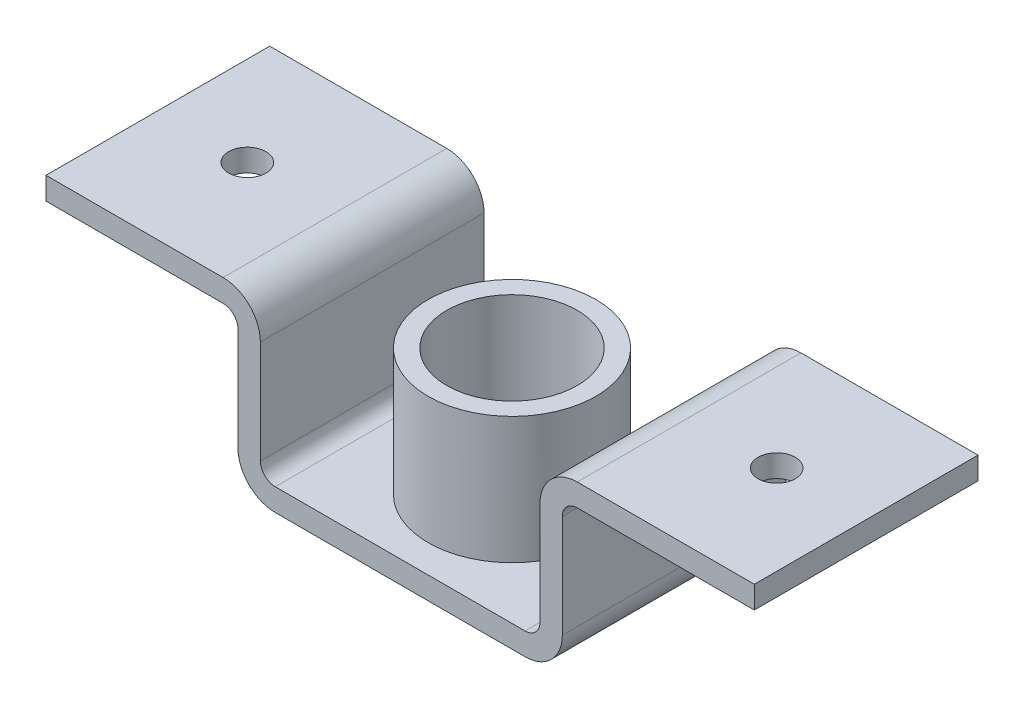
ISO-10303-21;
HEADER;
FILE_DESCRIPTION(('STEP AP214'),'2;1');
FILE_NAME('part.step','',(''),(''),'','','');
FILE_SCHEMA(('AUTOMOTIVE_DESIGN { 1 0 10303 214 1 1 1 1 }'));
ENDSEC;
DATA;
#1=APPLICATION_CONTEXT('core data for automotive mechanical design processes');
#2=APPLICATION_PROTOCOL_DEFINITION('international standard','automotive_design',2000,#1);
#3=PRODUCT_CONTEXT('',#1,'mechanical');
#4=PRODUCT('Part','Part','',(#3));
#5=PRODUCT_RELATED_PRODUCT_CATEGORY('part','',(#4));
#6=PRODUCT_DEFINITION_FORMATION('','',#4);
#7=PRODUCT_DEFINITION_CONTEXT('part definition',#1,'design');
#8=PRODUCT_DEFINITION('design','',#6,#7);
#9=PRODUCT_DEFINITION_SHAPE('','',#8);
#10=(LENGTH_UNIT() NAMED_UNIT(*) SI_UNIT(.MILLI.,.METRE.));
#11=(NAMED_UNIT(*) PLANE_ANGLE_UNIT() SI_UNIT($,.RADIAN.));
#12=(NAMED_UNIT(*) SI_UNIT($,.STERADIAN.) SOLID_ANGLE_UNIT());
#13=UNCERTAINTY_MEASURE_WITH_UNIT(LENGTH_MEASURE(1.E-05),#10,'distance_accuracy_value','');
#14=(GEOMETRIC_REPRESENTATION_CONTEXT(3) GLOBAL_UNCERTAINTY_ASSIGNED_CONTEXT((#13)) GLOBAL_UNIT_ASSIGNED_CONTEXT((#10,
#11,#12)) REPRESENTATION_CONTEXT('',''));
#15=CARTESIAN_POINT('',(0.,0.,0.));
#16=DIRECTION('',(0.,0.,1.));
#17=DIRECTION('',(1.,0.,0.));
#18=AXIS2_PLACEMENT_3D('',#15,#16,#17);
#19=CARTESIAN_POINT('',(-167.5,50.,300.));
#20=DIRECTION('',(0.,0.,-1.));
#21=DIRECTION('',(-1.,0.,0.));
#22=AXIS2_PLACEMENT_3D('',#19,#20,#21);
#23=CYLINDRICAL_SURFACE('',#22,50.);
#24=CARTESIAN_POINT('',(-167.5,50.,0.));
#25=DIRECTION('',(0.,0.,1.));
#26=DIRECTION('',(-1.,0.,0.));
#27=AXIS2_PLACEMENT_3D('',#24,#25,#26);
#28=CIRCLE('',#27,50.);
#29=CARTESIAN_POINT('',(-217.5,50.,0.));
#30=VERTEX_POINT('',#29);
#31=CARTESIAN_POINT('',(-167.5,0.,0.));
#32=VERTEX_POINT('',#31);
#33=EDGE_CURVE('E220',#30,#32,#28,.T.);
#34=ORIENTED_EDGE('',*,*,#33,.T.);
#35=DIRECTION('',(0.,0.,-1.));
#36=VECTOR('',#35,1.);
#37=CARTESIAN_POINT('',(-167.5,0.,300.));
#38=LINE('',#37,#36);
#39=CARTESIAN_POINT('',(-167.5,0.,300.));
#40=VERTEX_POINT('',#39);
#41=EDGE_CURVE('E53',#40,#32,#38,.T.);
#42=ORIENTED_EDGE('',*,*,#41,.F.);
#43=CARTESIAN_POINT('',(-167.5,50.,300.));
#44=DIRECTION('',(0.,0.,1.));
#45=DIRECTION('',(-1.,0.,0.));
#46=AXIS2_PLACEMENT_3D('',#43,#44,#45);
#47=CIRCLE('',#46,50.);
#48=CARTESIAN_POINT('',(-217.5,50.,300.));
#49=VERTEX_POINT('',#48);
#50=EDGE_CURVE('E279',#49,#40,#47,.T.);
#51=ORIENTED_EDGE('',*,*,#50,.F.);
#52=DIRECTION('',(0.,0.,-1.));
#53=VECTOR('',#52,1.);
#54=CARTESIAN_POINT('',(-217.5,50.,300.));
#55=LINE('',#54,#53);
#56=EDGE_CURVE('E216',#49,#30,#55,.T.);
#57=ORIENTED_EDGE('',*,*,#56,.T.);
#58=EDGE_LOOP('',(#34,#42,#51,#57));
#59=FACE_BOUND('',#58,.T.);
#60=ADVANCED_FACE('F43',(#59),#23,.T.);
#61=CARTESIAN_POINT('',(167.5,0.,300.));
#62=DIRECTION('',(0.,1.,0.));
#63=DIRECTION('',(0.,0.,1.));
#64=AXIS2_PLACEMENT_3D('',#61,#62,#63);
#65=PLANE('',#64);
#66=CARTESIAN_POINT('',(0.,0.,150.));
#67=DIRECTION('',(0.,1.,0.));
#68=DIRECTION('',(0.,0.,1.));
#69=AXIS2_PLACEMENT_3D('',#66,#67,#68);
#70=CIRCLE('',#69,37.5);
#71=CARTESIAN_POINT('',(0.,0.,187.5));
#72=VERTEX_POINT('',#71);
#73=EDGE_CURVE('E347',#72,#72,#70,.T.);
#74=ORIENTED_EDGE('',*,*,#73,.T.);
#75=EDGE_LOOP('',(#74));
#76=FACE_BOUND('',#75,.T.);
#77=DIRECTION('',(1.,0.,0.));
#78=VECTOR('',#77,1.);
#79=CARTESIAN_POINT('',(167.5,0.,0.));
#80=LINE('',#79,#78);
#81=CARTESIAN_POINT('',(167.5,0.,0.));
#82=VERTEX_POINT('',#81);
#83=EDGE_CURVE('E224',#32,#82,#80,.T.);
#84=ORIENTED_EDGE('',*,*,#83,.T.);
#85=DIRECTION('',(0.,0.,-1.));
#86=VECTOR('',#85,1.);
#87=CARTESIAN_POINT('',(167.5,0.,300.));
#88=LINE('',#87,#86);
#89=CARTESIAN_POINT('',(167.5,0.,300.));
#90=VERTEX_POINT('',#89);
#91=EDGE_CURVE('E342',#90,#82,#88,.T.);
#92=ORIENTED_EDGE('',*,*,#91,.F.);
#93=DIRECTION('',(1.,0.,0.));
#94=VECTOR('',#93,1.);
#95=CARTESIAN_POINT('',(167.5,0.,300.));
#96=LINE('',#95,#94);
#97=EDGE_CURVE('E142',#40,#90,#96,.T.);
#98=ORIENTED_EDGE('',*,*,#97,.F.);
#99=ORIENTED_EDGE('',*,*,#41,.T.);
#100=EDGE_LOOP('',(#84,#92,#98,#99));
#101=FACE_BOUND('',#100,.T.);
#102=ADVANCED_FACE('F449',(#76,#101),#65,.F.);
#103=CARTESIAN_POINT('',(167.5,50.,300.));
#104=DIRECTION('',(0.,0.,-1.));
#105=DIRECTION('',(-1.,0.,0.));
#106=AXIS2_PLACEMENT_3D('',#103,#104,#105);
#107=CYLINDRICAL_SURFACE('',#106,50.);
#108=CARTESIAN_POINT('',(167.5,50.,0.));
#109=DIRECTION('',(0.,0.,1.));
#110=DIRECTION('',(1.,0.,0.));
#111=AXIS2_PLACEMENT_3D('',#108,#109,#110);
#112=CIRCLE('',#111,50.);
#113=CARTESIAN_POINT('',(217.5,50.,0.));
#114=VERTEX_POINT('',#113);
#115=EDGE_CURVE('E228',#82,#114,#112,.T.);
#116=ORIENTED_EDGE('',*,*,#115,.T.);
#117=DIRECTION('',(0.,0.,-1.));
#118=VECTOR('',#117,1.);
#119=CARTESIAN_POINT('',(217.5,50.,300.));
#120=LINE('',#119,#118);
#121=CARTESIAN_POINT('',(217.5,50.,300.));
#122=VERTEX_POINT('',#121);
#123=EDGE_CURVE('E338',#122,#114,#120,.T.);
#124=ORIENTED_EDGE('',*,*,#123,.F.);
#125=CARTESIAN_POINT('',(167.5,50.,300.));
#126=DIRECTION('',(0.,0.,1.));
#127=DIRECTION('',(1.,0.,0.));
#128=AXIS2_PLACEMENT_3D('',#125,#126,#127);
#129=CIRCLE('',#128,50.);
#130=EDGE_CURVE('E379',#90,#122,#129,.T.);
#131=ORIENTED_EDGE('',*,*,#130,.F.);
#132=ORIENTED_EDGE('',*,*,#91,.T.);
#133=EDGE_LOOP('',(#116,#124,#131,#132));
#134=FACE_BOUND('',#133,.T.);
#135=ADVANCED_FACE('F452',(#134),#107,.T.);
#136=CARTESIAN_POINT('',(217.5,50.,300.));
#137=DIRECTION('',(-1.,0.,0.));
#138=DIRECTION('',(0.,-1.,0.));
#139=AXIS2_PLACEMENT_3D('',#136,#137,#138);
#140=PLANE('',#139);
#141=DIRECTION('',(0.,1.,0.));
#142=VECTOR('',#141,1.);
#143=CARTESIAN_POINT('',(217.5,50.,0.));
#144=LINE('',#143,#142);
#145=CARTESIAN_POINT('',(217.5,188.,0.));
#146=VERTEX_POINT('',#145);
#147=EDGE_CURVE('E231',#114,#146,#144,.T.);
#148=ORIENTED_EDGE('',*,*,#147,.T.);
#149=DIRECTION('',(0.,0.,-1.));
#150=VECTOR('',#149,1.);
#151=CARTESIAN_POINT('',(217.5,188.,300.));
#152=LINE('',#151,#150);
#153=CARTESIAN_POINT('',(217.5,188.,300.));
#154=VERTEX_POINT('',#153);
#155=EDGE_CURVE('E334',#154,#146,#152,.T.);
#156=ORIENTED_EDGE('',*,*,#155,.F.);
#157=DIRECTION('',(0.,1.,0.));
#158=VECTOR('',#157,1.);
#159=CARTESIAN_POINT('',(217.5,50.,300.));
#160=LINE('',#159,#158);
#161=EDGE_CURVE('E382',#122,#154,#160,.T.);
#162=ORIENTED_EDGE('',*,*,#161,.F.);
#163=ORIENTED_EDGE('',*,*,#123,.T.);
#164=EDGE_LOOP('',(#148,#156,#162,#163));
#165=FACE_BOUND('',#164,.T.);
#166=ADVANCED_FACE('F455',(#165),#140,.F.);
#167=CARTESIAN_POINT('',(237.5,188.,300.));
#168=DIRECTION('',(0.,0.,-1.));
#169=DIRECTION('',(-1.,0.,0.));
#170=AXIS2_PLACEMENT_3D('',#167,#168,#169);
#171=CYLINDRICAL_SURFACE('',#170,20.);
#172=CARTESIAN_POINT('',(237.5,188.,0.));
#173=DIRECTION('',(0.,0.,-1.));
#174=DIRECTION('',(-1.,0.,0.));
#175=AXIS2_PLACEMENT_3D('',#172,#173,#174);
#176=CIRCLE('',#175,20.);
#177=CARTESIAN_POINT('',(237.5,208.,0.));
#178=VERTEX_POINT('',#177);
#179=EDGE_CURVE('E234',#146,#178,#176,.T.);
#180=ORIENTED_EDGE('',*,*,#179,.T.);
#181=DIRECTION('',(0.,0.,-1.));
#182=VECTOR('',#181,1.);
#183=CARTESIAN_POINT('',(237.5,208.,300.));
#184=LINE('',#183,#182);
#185=CARTESIAN_POINT('',(237.5,208.,300.));
#186=VERTEX_POINT('',#185);
#187=EDGE_CURVE('E330',#186,#178,#184,.T.);
#188=ORIENTED_EDGE('',*,*,#187,.F.);
#189=CARTESIAN_POINT('',(237.5,188.,300.));
#190=DIRECTION('',(0.,0.,-1.));
#191=DIRECTION('',(-1.,0.,0.));
#192=AXIS2_PLACEMENT_3D('',#189,#190,#191);
#193=CIRCLE('',#192,20.);
#194=EDGE_CURVE('E385',#154,#186,#193,.T.);
#195=ORIENTED_EDGE('',*,*,#194,.F.);
#196=ORIENTED_EDGE('',*,*,#155,.T.);
#197=EDGE_LOOP('',(#180,#188,#195,#196));
#198=FACE_BOUND('',#197,.T.);
#199=ADVANCED_FACE('F461',(#198),#171,.F.);
#200=CARTESIAN_POINT('',(237.5,208.,300.));
#201=DIRECTION('',(0.,1.,0.));
#202=DIRECTION('',(0.,0.,1.));
#203=AXIS2_PLACEMENT_3D('',#200,#201,#202);
#204=PLANE('',#203);
#205=CARTESIAN_POINT('',(355.,208.,150.));
#206=DIRECTION('',(0.,1.,0.));
#207=DIRECTION('',(0.,0.,1.));
#208=AXIS2_PLACEMENT_3D('',#205,#206,#207);
#209=CIRCLE('',#208,25.);
#210=CARTESIAN_POINT('',(355.,208.,175.));
#211=VERTEX_POINT('',#210);
#212=EDGE_CURVE('E360',#211,#211,#209,.T.);
#213=ORIENTED_EDGE('',*,*,#212,.T.);
#214=EDGE_LOOP('',(#213));
#215=FACE_BOUND('',#214,.T.);
#216=DIRECTION('',(1.,0.,0.));
#217=VECTOR('',#216,1.);
#218=CARTESIAN_POINT('',(237.5,208.,0.));
#219=LINE('',#218,#217);
#220=CARTESIAN_POINT('',(475.,208.,0.));
#221=VERTEX_POINT('',#220);
#222=EDGE_CURVE('E237',#178,#221,#219,.T.);
#223=ORIENTED_EDGE('',*,*,#222,.T.);
#224=DIRECTION('',(0.,0.,-1.));
#225=VECTOR('',#224,1.);
#226=CARTESIAN_POINT('',(475.,208.,300.));
#227=LINE('',#226,#225);
#228=CARTESIAN_POINT('',(475.,208.,300.));
#229=VERTEX_POINT('',#228);
#230=EDGE_CURVE('E326',#229,#221,#227,.T.);
#231=ORIENTED_EDGE('',*,*,#230,.F.);
#232=DIRECTION('',(1.,0.,0.));
#233=VECTOR('',#232,1.);
#234=CARTESIAN_POINT('',(237.5,208.,300.));
#235=LINE('',#234,#233);
#236=EDGE_CURVE('E388',#186,#229,#235,.T.);
#237=ORIENTED_EDGE('',*,*,#236,.F.);
#238=ORIENTED_EDGE('',*,*,#187,.T.);
#239=EDGE_LOOP('',(#223,#231,#237,#238));
#240=FACE_BOUND('',#239,.T.);
#241=ADVANCED_FACE('F465',(#215,#240),#204,.F.);
#242=CARTESIAN_POINT('',(475.,208.,300.));
#243=DIRECTION('',(-1.,0.,0.));
#244=DIRECTION('',(0.,0.,1.));
#245=AXIS2_PLACEMENT_3D('',#242,#243,#244);
#246=PLANE('',#245);
#247=DIRECTION('',(0.,1.,0.));
#248=VECTOR('',#247,1.);
#249=CARTESIAN_POINT('',(475.,208.,0.));
#250=LINE('',#249,#248);
#251=CARTESIAN_POINT('',(475.,238.,0.));
#252=VERTEX_POINT('',#251);
#253=EDGE_CURVE('E240',#221,#252,#250,.T.);
#254=ORIENTED_EDGE('',*,*,#253,.T.);
#255=DIRECTION('',(0.,0.,-1.));
#256=VECTOR('',#255,1.);
#257=CARTESIAN_POINT('',(475.,238.,300.));
#258=LINE('',#257,#256);
#259=CARTESIAN_POINT('',(475.,238.,300.));
#260=VERTEX_POINT('',#259);
#261=EDGE_CURVE('E322',#260,#252,#258,.T.);
#262=ORIENTED_EDGE('',*,*,#261,.F.);
#263=DIRECTION('',(0.,1.,0.));
#264=VECTOR('',#263,1.);
#265=CARTESIAN_POINT('',(475.,208.,300.));
#266=LINE('',#265,#264);
#267=EDGE_CURVE('E391',#229,#260,#266,.T.);
#268=ORIENTED_EDGE('',*,*,#267,.F.);
#269=ORIENTED_EDGE('',*,*,#230,.T.);
#270=EDGE_LOOP('',(#254,#262,#268,#269));
#271=FACE_BOUND('',#270,.T.);
#272=ADVANCED_FACE('F469',(#271),#246,.F.);
#273=CARTESIAN_POINT('',(475.,238.,300.));
#274=DIRECTION('',(0.,-1.,0.));
#275=DIRECTION('',(1.,0.,0.));
#276=AXIS2_PLACEMENT_3D('',#273,#274,#275);
#277=PLANE('',#276);
#278=CARTESIAN_POINT('',(355.,238.,150.));
#279=DIRECTION('',(0.,1.,0.));
#280=DIRECTION('',(-1.,0.,0.));
#281=AXIS2_PLACEMENT_3D('',#278,#279,#280);
#282=CIRCLE('',#281,25.);
#283=CARTESIAN_POINT('',(330.,238.,150.));
#284=VERTEX_POINT('',#283);
#285=EDGE_CURVE('E518',#284,#284,#282,.T.);
#286=ORIENTED_EDGE('',*,*,#285,.F.);
#287=EDGE_LOOP('',(#286));
#288=FACE_BOUND('',#287,.T.);
#289=DIRECTION('',(-1.,0.,0.));
#290=VECTOR('',#289,1.);
#291=CARTESIAN_POINT('',(475.,238.,0.));
#292=LINE('',#291,#290);
#293=CARTESIAN_POINT('',(237.5,238.,0.));
#294=VERTEX_POINT('',#293);
#295=EDGE_CURVE('E243',#252,#294,#292,.T.);
#296=ORIENTED_EDGE('',*,*,#295,.T.);
#297=DIRECTION('',(0.,0.,-1.));
#298=VECTOR('',#297,1.);
#299=CARTESIAN_POINT('',(237.5,238.,300.));
#300=LINE('',#299,#298);
#301=CARTESIAN_POINT('',(237.5,238.,300.));
#302=VERTEX_POINT('',#301);
#303=EDGE_CURVE('E318',#302,#294,#300,.T.);
#304=ORIENTED_EDGE('',*,*,#303,.F.);
#305=DIRECTION('',(-1.,0.,0.));
#306=VECTOR('',#305,1.);
#307=CARTESIAN_POINT('',(475.,238.,300.));
#308=LINE('',#307,#306);
#309=EDGE_CURVE('E394',#260,#302,#308,.T.);
#310=ORIENTED_EDGE('',*,*,#309,.F.);
#311=ORIENTED_EDGE('',*,*,#261,.T.);
#312=EDGE_LOOP('',(#296,#304,#310,#311));
#313=FACE_BOUND('',#312,.T.);
#314=ADVANCED_FACE('F473',(#288,#313),#277,.F.);
#315=CARTESIAN_POINT('',(237.5,188.,300.));
#316=DIRECTION('',(0.,0.,-1.));
#317=DIRECTION('',(-1.,0.,0.));
#318=AXIS2_PLACEMENT_3D('',#315,#316,#317);
#319=CYLINDRICAL_SURFACE('',#318,50.);
#320=CARTESIAN_POINT('',(237.5,188.,0.));
#321=DIRECTION('',(0.,0.,1.));
#322=DIRECTION('',(1.,0.,0.));
#323=AXIS2_PLACEMENT_3D('',#320,#321,#322);
#324=CIRCLE('',#323,50.);
#325=CARTESIAN_POINT('',(187.5,188.,0.));
#326=VERTEX_POINT('',#325);
#327=EDGE_CURVE('E246',#294,#326,#324,.T.);
#328=ORIENTED_EDGE('',*,*,#327,.T.);
#329=DIRECTION('',(0.,0.,-1.));
#330=VECTOR('',#329,1.);
#331=CARTESIAN_POINT('',(187.5,188.,300.));
#332=LINE('',#331,#330);
#333=CARTESIAN_POINT('',(187.5,188.,300.));
#334=VERTEX_POINT('',#333);
#335=EDGE_CURVE('E314',#334,#326,#332,.T.);
#336=ORIENTED_EDGE('',*,*,#335,.F.);
#337=CARTESIAN_POINT('',(237.5,188.,300.));
#338=DIRECTION('',(0.,0.,1.));
#339=DIRECTION('',(1.,0.,0.));
#340=AXIS2_PLACEMENT_3D('',#337,#338,#339);
#341=CIRCLE('',#340,50.);
#342=EDGE_CURVE('E397',#302,#334,#341,.T.);
#343=ORIENTED_EDGE('',*,*,#342,.F.);
#344=ORIENTED_EDGE('',*,*,#303,.T.);
#345=EDGE_LOOP('',(#328,#336,#343,#344));
#346=FACE_BOUND('',#345,.T.);
#347=ADVANCED_FACE('F477',(#346),#319,.T.);
#348=CARTESIAN_POINT('',(187.5,188.,300.));
#349=DIRECTION('',(1.,0.,0.));
#350=DIRECTION('',(0.,0.,-1.));
#351=AXIS2_PLACEMENT_3D('',#348,#349,#350);
#352=PLANE('',#351);
#353=DIRECTION('',(0.,-1.,0.));
#354=VECTOR('',#353,1.);
#355=CARTESIAN_POINT('',(187.5,188.,0.));
#356=LINE('',#355,#354);
#357=CARTESIAN_POINT('',(187.5,50.,0.));
#358=VERTEX_POINT('',#357);
#359=EDGE_CURVE('E249',#326,#358,#356,.T.);
#360=ORIENTED_EDGE('',*,*,#359,.T.);
#361=DIRECTION('',(0.,0.,-1.));
#362=VECTOR('',#361,1.);
#363=CARTESIAN_POINT('',(187.5,50.,300.));
#364=LINE('',#363,#362);
#365=CARTESIAN_POINT('',(187.5,50.,300.));
#366=VERTEX_POINT('',#365);
#367=EDGE_CURVE('E310',#366,#358,#364,.T.);
#368=ORIENTED_EDGE('',*,*,#367,.F.);
#369=DIRECTION('',(0.,-1.,0.));
#370=VECTOR('',#369,1.);
#371=CARTESIAN_POINT('',(187.5,188.,300.));
#372=LINE('',#371,#370);
#373=EDGE_CURVE('E400',#334,#366,#372,.T.);
#374=ORIENTED_EDGE('',*,*,#373,.F.);
#375=ORIENTED_EDGE('',*,*,#335,.T.);
#376=EDGE_LOOP('',(#360,#368,#374,#375));
#377=FACE_BOUND('',#376,.T.);
#378=ADVANCED_FACE('F481',(#377),#352,.F.);
#379=CARTESIAN_POINT('',(167.5,50.,300.));
#380=DIRECTION('',(0.,0.,-1.));
#381=DIRECTION('',(-1.,0.,0.));
#382=AXIS2_PLACEMENT_3D('',#379,#380,#381);
#383=CYLINDRICAL_SURFACE('',#382,20.);
#384=CARTESIAN_POINT('',(167.5,50.,0.));
#385=DIRECTION('',(0.,0.,-1.));
#386=DIRECTION('',(-1.,0.,0.));
#387=AXIS2_PLACEMENT_3D('',#384,#385,#386);
#388=CIRCLE('',#387,20.);
#389=CARTESIAN_POINT('',(167.5,30.,0.));
#390=VERTEX_POINT('',#389);
#391=EDGE_CURVE('E252',#358,#390,#388,.T.);
#392=ORIENTED_EDGE('',*,*,#391,.T.);
#393=DIRECTION('',(0.,0.,-1.));
#394=VECTOR('',#393,1.);
#395=CARTESIAN_POINT('',(167.5,30.,300.));
#396=LINE('',#395,#394);
#397=CARTESIAN_POINT('',(167.5,30.,300.));
#398=VERTEX_POINT('',#397);
#399=EDGE_CURVE('E306',#398,#390,#396,.T.);
#400=ORIENTED_EDGE('',*,*,#399,.F.);
#401=CARTESIAN_POINT('',(167.5,50.,300.));
#402=DIRECTION('',(0.,0.,-1.));
#403=DIRECTION('',(-1.,0.,0.));
#404=AXIS2_PLACEMENT_3D('',#401,#402,#403);
#405=CIRCLE('',#404,20.);
#406=EDGE_CURVE('E403',#366,#398,#405,.T.);
#407=ORIENTED_EDGE('',*,*,#406,.F.);
#408=ORIENTED_EDGE('',*,*,#367,.T.);
#409=EDGE_LOOP('',(#392,#400,#407,#408));
#410=FACE_BOUND('',#409,.T.);
#411=ADVANCED_FACE('F485',(#410),#383,.F.);
#412=CARTESIAN_POINT('',(-167.5,30.,300.));
#413=DIRECTION('',(0.,-1.,0.));
#414=DIRECTION('',(0.,0.,-1.));
#415=AXIS2_PLACEMENT_3D('',#412,#413,#414);
#416=PLANE('',#415);
#417=CARTESIAN_POINT('',(0.,30.,150.));
#418=DIRECTION('',(0.,-1.,0.));
#419=DIRECTION('',(0.,0.,-1.));
#420=AXIS2_PLACEMENT_3D('',#417,#418,#419);
#421=CIRCLE('',#420,112.5);
#422=CARTESIAN_POINT('',(0.,30.,37.5));
#423=VERTEX_POINT('',#422);
#424=EDGE_CURVE('E11',#423,#423,#421,.F.);
#425=ORIENTED_EDGE('',*,*,#424,.F.);
#426=EDGE_LOOP('',(#425));
#427=FACE_BOUND('',#426,.T.);
#428=DIRECTION('',(-1.,0.,0.));
#429=VECTOR('',#428,1.);
#430=CARTESIAN_POINT('',(-167.5,30.,0.));
#431=LINE('',#430,#429);
#432=CARTESIAN_POINT('',(-167.5,30.,0.));
#433=VERTEX_POINT('',#432);
#434=EDGE_CURVE('E255',#390,#433,#431,.T.);
#435=ORIENTED_EDGE('',*,*,#434,.T.);
#436=DIRECTION('',(0.,0.,-1.));
#437=VECTOR('',#436,1.);
#438=CARTESIAN_POINT('',(-167.5,30.,300.));
#439=LINE('',#438,#437);
#440=CARTESIAN_POINT('',(-167.5,30.,300.));
#441=VERTEX_POINT('',#440);
#442=EDGE_CURVE('E302',#441,#433,#439,.T.);
#443=ORIENTED_EDGE('',*,*,#442,.F.);
#444=DIRECTION('',(-1.,0.,0.));
#445=VECTOR('',#444,1.);
#446=CARTESIAN_POINT('',(-167.5,30.,300.));
#447=LINE('',#446,#445);
#448=EDGE_CURVE('E406',#398,#441,#447,.T.);
#449=ORIENTED_EDGE('',*,*,#448,.F.);
#450=ORIENTED_EDGE('',*,*,#399,.T.);
#451=EDGE_LOOP('',(#435,#443,#449,#450));
#452=FACE_BOUND('',#451,.T.);
#453=ADVANCED_FACE('F489',(#427,#452),#416,.F.);
#454=CARTESIAN_POINT('',(-167.5,50.,300.));
#455=DIRECTION('',(0.,0.,-1.));
#456=DIRECTION('',(-1.,0.,0.));
#457=AXIS2_PLACEMENT_3D('',#454,#455,#456);
#458=CYLINDRICAL_SURFACE('',#457,20.);
#459=CARTESIAN_POINT('',(-167.5,50.,0.));
#460=DIRECTION('',(0.,0.,-1.));
#461=DIRECTION('',(1.,0.,0.));
#462=AXIS2_PLACEMENT_3D('',#459,#460,#461);
#463=CIRCLE('',#462,20.);
#464=CARTESIAN_POINT('',(-187.5,50.,0.));
#465=VERTEX_POINT('',#464);
#466=EDGE_CURVE('E258',#433,#465,#463,.T.);
#467=ORIENTED_EDGE('',*,*,#466,.T.);
#468=DIRECTION('',(0.,0.,-1.));
#469=VECTOR('',#468,1.);
#470=CARTESIAN_POINT('',(-187.5,50.,300.));
#471=LINE('',#470,#469);
#472=CARTESIAN_POINT('',(-187.5,50.,300.));
#473=VERTEX_POINT('',#472);
#474=EDGE_CURVE('E298',#473,#465,#471,.T.);
#475=ORIENTED_EDGE('',*,*,#474,.F.);
#476=CARTESIAN_POINT('',(-167.5,50.,300.));
#477=DIRECTION('',(0.,0.,-1.));
#478=DIRECTION('',(1.,0.,0.));
#479=AXIS2_PLACEMENT_3D('',#476,#477,#478);
#480=CIRCLE('',#479,20.);
#481=EDGE_CURVE('E409',#441,#473,#480,.T.);
#482=ORIENTED_EDGE('',*,*,#481,.F.);
#483=ORIENTED_EDGE('',*,*,#442,.T.);
#484=EDGE_LOOP('',(#467,#475,#482,#483));
#485=FACE_BOUND('',#484,.T.);
#486=ADVANCED_FACE('F493',(#485),#458,.F.);
#487=CARTESIAN_POINT('',(-187.5,188.,300.));
#488=DIRECTION('',(-1.,0.,0.));
#489=DIRECTION('',(0.,0.,1.));
#490=AXIS2_PLACEMENT_3D('',#487,#488,#489);
#491=PLANE('',#490);
#492=DIRECTION('',(0.,1.,0.));
#493=VECTOR('',#492,1.);
#494=CARTESIAN_POINT('',(-187.5,188.,0.));
#495=LINE('',#494,#493);
#496=CARTESIAN_POINT('',(-187.5,188.,0.));
#497=VERTEX_POINT('',#496);
#498=EDGE_CURVE('E261',#465,#497,#495,.T.);
#499=ORIENTED_EDGE('',*,*,#498,.T.);
#500=DIRECTION('',(0.,0.,-1.));
#501=VECTOR('',#500,1.);
#502=CARTESIAN_POINT('',(-187.5,188.,300.));
#503=LINE('',#502,#501);
#504=CARTESIAN_POINT('',(-187.5,188.,300.));
#505=VERTEX_POINT('',#504);
#506=EDGE_CURVE('E294',#505,#497,#503,.T.);
#507=ORIENTED_EDGE('',*,*,#506,.F.);
#508=DIRECTION('',(0.,1.,0.));
#509=VECTOR('',#508,1.);
#510=CARTESIAN_POINT('',(-187.5,188.,300.));
#511=LINE('',#510,#509);
#512=EDGE_CURVE('E412',#473,#505,#511,.T.);
#513=ORIENTED_EDGE('',*,*,#512,.F.);
#514=ORIENTED_EDGE('',*,*,#474,.T.);
#515=EDGE_LOOP('',(#499,#507,#513,#514));
#516=FACE_BOUND('',#515,.T.);
#517=ADVANCED_FACE('F498',(#516),#491,.F.);
#518=CARTESIAN_POINT('',(-237.5,188.,300.));
#519=DIRECTION('',(0.,0.,-1.));
#520=DIRECTION('',(-1.,0.,0.));
#521=AXIS2_PLACEMENT_3D('',#518,#519,#520);
#522=CYLINDRICAL_SURFACE('',#521,50.);
#523=CARTESIAN_POINT('',(-237.5,188.,0.));
#524=DIRECTION('',(0.,0.,1.));
#525=DIRECTION('',(-1.,0.,0.));
#526=AXIS2_PLACEMENT_3D('',#523,#524,#525);
#527=CIRCLE('',#526,50.);
#528=CARTESIAN_POINT('',(-237.5,238.,0.));
#529=VERTEX_POINT('',#528);
#530=EDGE_CURVE('E264',#497,#529,#527,.T.);
#531=ORIENTED_EDGE('',*,*,#530,.T.);
#532=DIRECTION('',(0.,0.,-1.));
#533=VECTOR('',#532,1.);
#534=CARTESIAN_POINT('',(-237.5,238.,300.));
#535=LINE('',#534,#533);
#536=CARTESIAN_POINT('',(-237.5,238.,300.));
#537=VERTEX_POINT('',#536);
#538=EDGE_CURVE('E290',#537,#529,#535,.T.);
#539=ORIENTED_EDGE('',*,*,#538,.F.);
#540=CARTESIAN_POINT('',(-237.5,188.,300.));
#541=DIRECTION('',(0.,0.,1.));
#542=DIRECTION('',(-1.,0.,0.));
#543=AXIS2_PLACEMENT_3D('',#540,#541,#542);
#544=CIRCLE('',#543,50.);
#545=EDGE_CURVE('E415',#505,#537,#544,.T.);
#546=ORIENTED_EDGE('',*,*,#545,.F.);
#547=ORIENTED_EDGE('',*,*,#506,.T.);
#548=EDGE_LOOP('',(#531,#539,#546,#547));
#549=FACE_BOUND('',#548,.T.);
#550=ADVANCED_FACE('F502',(#549),#522,.T.);
#551=CARTESIAN_POINT('',(-475.,238.,300.));
#552=DIRECTION('',(0.,-1.,0.));
#553=DIRECTION('',(1.,0.,0.));
#554=AXIS2_PLACEMENT_3D('',#551,#552,#553);
#555=PLANE('',#554);
#556=CARTESIAN_POINT('',(-355.,238.,150.));
#557=DIRECTION('',(0.,1.,0.));
#558=DIRECTION('',(-1.,0.,0.));
#559=AXIS2_PLACEMENT_3D('',#556,#557,#558);
#560=CIRCLE('',#559,25.);
#561=CARTESIAN_POINT('',(-380.,238.,150.));
#562=VERTEX_POINT('',#561);
#563=EDGE_CURVE('E521',#562,#562,#560,.T.);
#564=ORIENTED_EDGE('',*,*,#563,.F.);
#565=EDGE_LOOP('',(#564));
#566=FACE_BOUND('',#565,.T.);
#567=DIRECTION('',(-1.,0.,0.));
#568=VECTOR('',#567,1.);
#569=CARTESIAN_POINT('',(-475.,238.,0.));
#570=LINE('',#569,#568);
#571=CARTESIAN_POINT('',(-475.,238.,0.));
#572=VERTEX_POINT('',#571);
#573=EDGE_CURVE('E267',#529,#572,#570,.T.);
#574=ORIENTED_EDGE('',*,*,#573,.T.);
#575=DIRECTION('',(0.,0.,-1.));
#576=VECTOR('',#575,1.);
#577=CARTESIAN_POINT('',(-475.,238.,300.));
#578=LINE('',#577,#576);
#579=CARTESIAN_POINT('',(-475.,238.,300.));
#580=VERTEX_POINT('',#579);
#581=EDGE_CURVE('E286',#580,#572,#578,.T.);
#582=ORIENTED_EDGE('',*,*,#581,.F.);
#583=DIRECTION('',(-1.,0.,0.));
#584=VECTOR('',#583,1.);
#585=CARTESIAN_POINT('',(-475.,238.,300.));
#586=LINE('',#585,#584);
#587=EDGE_CURVE('E418',#537,#580,#586,.T.);
#588=ORIENTED_EDGE('',*,*,#587,.F.);
#589=ORIENTED_EDGE('',*,*,#538,.T.);
#590=EDGE_LOOP('',(#574,#582,#588,#589));
#591=FACE_BOUND('',#590,.T.);
#592=ADVANCED_FACE('F427',(#566,#591),#555,.F.);
#593=CARTESIAN_POINT('',(-475.,208.,300.));
#594=DIRECTION('',(1.,0.,0.));
#595=DIRECTION('',(0.,0.,-1.));
#596=AXIS2_PLACEMENT_3D('',#593,#594,#595);
#597=PLANE('',#596);
#598=DIRECTION('',(0.,-1.,0.));
#599=VECTOR('',#598,1.);
#600=CARTESIAN_POINT('',(-475.,208.,0.));
#601=LINE('',#600,#599);
#602=CARTESIAN_POINT('',(-475.,208.,0.));
#603=VERTEX_POINT('',#602);
#604=EDGE_CURVE('E270',#572,#603,#601,.T.);
#605=ORIENTED_EDGE('',*,*,#604,.T.);
#606=DIRECTION('',(0.,0.,-1.));
#607=VECTOR('',#606,1.);
#608=CARTESIAN_POINT('',(-475.,208.,300.));
#609=LINE('',#608,#607);
#610=CARTESIAN_POINT('',(-475.,208.,300.));
#611=VERTEX_POINT('',#610);
#612=EDGE_CURVE('E208',#611,#603,#609,.T.);
#613=ORIENTED_EDGE('',*,*,#612,.F.);
#614=DIRECTION('',(0.,-1.,0.));
#615=VECTOR('',#614,1.);
#616=CARTESIAN_POINT('',(-475.,208.,300.));
#617=LINE('',#616,#615);
#618=EDGE_CURVE('E197',#580,#611,#617,.T.);
#619=ORIENTED_EDGE('',*,*,#618,.F.);
#620=ORIENTED_EDGE('',*,*,#581,.T.);
#621=EDGE_LOOP('',(#605,#613,#619,#620));
#622=FACE_BOUND('',#621,.T.);
#623=ADVANCED_FACE('F431',(#622),#597,.F.);
#624=CARTESIAN_POINT('',(-237.5,208.,300.));
#625=DIRECTION('',(0.,1.,0.));
#626=DIRECTION('',(0.,0.,1.));
#627=AXIS2_PLACEMENT_3D('',#624,#625,#626);
#628=PLANE('',#627);
#629=CARTESIAN_POINT('',(-355.,208.,150.));
#630=DIRECTION('',(0.,1.,0.));
#631=DIRECTION('',(0.,0.,1.));
#632=AXIS2_PLACEMENT_3D('',#629,#630,#631);
#633=CIRCLE('',#632,25.);
#634=CARTESIAN_POINT('',(-355.,208.,175.));
#635=VERTEX_POINT('',#634);
#636=EDGE_CURVE('E46',#635,#635,#633,.T.);
#637=ORIENTED_EDGE('',*,*,#636,.T.);
#638=EDGE_LOOP('',(#637));
#639=FACE_BOUND('',#638,.T.);
#640=DIRECTION('',(1.,0.,0.));
#641=VECTOR('',#640,1.);
#642=CARTESIAN_POINT('',(-237.5,208.,0.));
#643=LINE('',#642,#641);
#644=CARTESIAN_POINT('',(-237.5,208.,0.));
#645=VERTEX_POINT('',#644);
#646=EDGE_CURVE('E206',#603,#645,#643,.T.);
#647=ORIENTED_EDGE('',*,*,#646,.T.);
#648=DIRECTION('',(0.,0.,-1.));
#649=VECTOR('',#648,1.);
#650=CARTESIAN_POINT('',(-237.5,208.,300.));
#651=LINE('',#650,#649);
#652=CARTESIAN_POINT('',(-237.5,208.,300.));
#653=VERTEX_POINT('',#652);
#654=EDGE_CURVE('E203',#653,#645,#651,.T.);
#655=ORIENTED_EDGE('',*,*,#654,.F.);
#656=DIRECTION('',(1.,0.,0.));
#657=VECTOR('',#656,1.);
#658=CARTESIAN_POINT('',(-237.5,208.,300.));
#659=LINE('',#658,#657);
#660=EDGE_CURVE('E191',#611,#653,#659,.T.);
#661=ORIENTED_EDGE('',*,*,#660,.F.);
#662=ORIENTED_EDGE('',*,*,#612,.T.);
#663=EDGE_LOOP('',(#647,#655,#661,#662));
#664=FACE_BOUND('',#663,.T.);
#665=ADVANCED_FACE('F204',(#639,#664),#628,.F.);
#666=CARTESIAN_POINT('',(-237.5,188.,300.));
#667=DIRECTION('',(0.,0.,-1.));
#668=DIRECTION('',(-1.,0.,0.));
#669=AXIS2_PLACEMENT_3D('',#666,#667,#668);
#670=CYLINDRICAL_SURFACE('',#669,20.);
#671=CARTESIAN_POINT('',(-237.5,188.,0.));
#672=DIRECTION('',(0.,0.,-1.));
#673=DIRECTION('',(1.,0.,0.));
#674=AXIS2_PLACEMENT_3D('',#671,#672,#673);
#675=CIRCLE('',#674,20.);
#676=CARTESIAN_POINT('',(-217.5,188.,0.));
#677=VERTEX_POINT('',#676);
#678=EDGE_CURVE('E127',#645,#677,#675,.T.);
#679=ORIENTED_EDGE('',*,*,#678,.T.);
#680=DIRECTION('',(0.,0.,-1.));
#681=VECTOR('',#680,1.);
#682=CARTESIAN_POINT('',(-217.5,188.,300.));
#683=LINE('',#682,#681);
#684=CARTESIAN_POINT('',(-217.5,188.,300.));
#685=VERTEX_POINT('',#684);
#686=EDGE_CURVE('E209',#685,#677,#683,.T.);
#687=ORIENTED_EDGE('',*,*,#686,.F.);
#688=CARTESIAN_POINT('',(-237.5,188.,300.));
#689=DIRECTION('',(0.,0.,-1.));
#690=DIRECTION('',(1.,0.,0.));
#691=AXIS2_PLACEMENT_3D('',#688,#689,#690);
#692=CIRCLE('',#691,20.);
#693=EDGE_CURVE('E195',#653,#685,#692,.T.);
#694=ORIENTED_EDGE('',*,*,#693,.F.);
#695=ORIENTED_EDGE('',*,*,#654,.T.);
#696=EDGE_LOOP('',(#679,#687,#694,#695));
#697=FACE_BOUND('',#696,.T.);
#698=ADVANCED_FACE('F211',(#697),#670,.F.);
#699=CARTESIAN_POINT('',(-217.5,50.,300.));
#700=DIRECTION('',(1.,0.,0.));
#701=DIRECTION('',(0.,1.,0.));
#702=AXIS2_PLACEMENT_3D('',#699,#700,#701);
#703=PLANE('',#702);
#704=DIRECTION('',(0.,-1.,0.));
#705=VECTOR('',#704,1.);
#706=CARTESIAN_POINT('',(-217.5,50.,0.));
#707=LINE('',#706,#705);
#708=EDGE_CURVE('E133',#677,#30,#707,.T.);
#709=ORIENTED_EDGE('',*,*,#708,.T.);
#710=ORIENTED_EDGE('',*,*,#56,.F.);
#711=DIRECTION('',(0.,-1.,0.));
#712=VECTOR('',#711,1.);
#713=CARTESIAN_POINT('',(-217.5,50.,300.));
#714=LINE('',#713,#712);
#715=EDGE_CURVE('E62',#685,#49,#714,.T.);
#716=ORIENTED_EDGE('',*,*,#715,.F.);
#717=ORIENTED_EDGE('',*,*,#686,.T.);
#718=EDGE_LOOP('',(#709,#710,#716,#717));
#719=FACE_BOUND('',#718,.T.);
#720=ADVANCED_FACE('F439',(#719),#703,.F.);
#721=CARTESIAN_POINT('',(-167.5,50.,300.));
#722=DIRECTION('',(0.,0.,-1.));
#723=DIRECTION('',(-1.,0.,0.));
#724=AXIS2_PLACEMENT_3D('',#721,#722,#723);
#725=PLANE('',#724);
#726=ORIENTED_EDGE('',*,*,#50,.T.);
#727=ORIENTED_EDGE('',*,*,#97,.T.);
#728=ORIENTED_EDGE('',*,*,#130,.T.);
#729=ORIENTED_EDGE('',*,*,#161,.T.);
#730=ORIENTED_EDGE('',*,*,#194,.T.);
#731=ORIENTED_EDGE('',*,*,#236,.T.);
#732=ORIENTED_EDGE('',*,*,#267,.T.);
#733=ORIENTED_EDGE('',*,*,#309,.T.);
#734=ORIENTED_EDGE('',*,*,#342,.T.);
#735=ORIENTED_EDGE('',*,*,#373,.T.);
#736=ORIENTED_EDGE('',*,*,#406,.T.);
#737=ORIENTED_EDGE('',*,*,#448,.T.);
#738=ORIENTED_EDGE('',*,*,#481,.T.);
#739=ORIENTED_EDGE('',*,*,#512,.T.);
#740=ORIENTED_EDGE('',*,*,#545,.T.);
#741=ORIENTED_EDGE('',*,*,#587,.T.);
#742=ORIENTED_EDGE('',*,*,#618,.T.);
#743=ORIENTED_EDGE('',*,*,#660,.T.);
#744=ORIENTED_EDGE('',*,*,#693,.T.);
#745=ORIENTED_EDGE('',*,*,#715,.T.);
#746=EDGE_LOOP('',(#726,#727,#728,#729,#730,#731,#732,#733,#734,#735,#736,#737,#738,#739,#740,
#741,#742,#743,#744,#745));
#747=FACE_BOUND('',#746,.T.);
#748=ADVANCED_FACE('F193',(#747),#725,.F.);
#749=CARTESIAN_POINT('',(-167.5,50.,0.));
#750=DIRECTION('',(0.,0.,-1.));
#751=DIRECTION('',(-1.,0.,0.));
#752=AXIS2_PLACEMENT_3D('',#749,#750,#751);
#753=PLANE('',#752);
#754=ORIENTED_EDGE('',*,*,#33,.F.);
#755=ORIENTED_EDGE('',*,*,#708,.F.);
#756=ORIENTED_EDGE('',*,*,#678,.F.);
#757=ORIENTED_EDGE('',*,*,#646,.F.);
#758=ORIENTED_EDGE('',*,*,#604,.F.);
#759=ORIENTED_EDGE('',*,*,#573,.F.);
#760=ORIENTED_EDGE('',*,*,#530,.F.);
#761=ORIENTED_EDGE('',*,*,#498,.F.);
#762=ORIENTED_EDGE('',*,*,#466,.F.);
#763=ORIENTED_EDGE('',*,*,#434,.F.);
#764=ORIENTED_EDGE('',*,*,#391,.F.);
#765=ORIENTED_EDGE('',*,*,#359,.F.);
#766=ORIENTED_EDGE('',*,*,#327,.F.);
#767=ORIENTED_EDGE('',*,*,#295,.F.);
#768=ORIENTED_EDGE('',*,*,#253,.F.);
#769=ORIENTED_EDGE('',*,*,#222,.F.);
#770=ORIENTED_EDGE('',*,*,#179,.F.);
#771=ORIENTED_EDGE('',*,*,#147,.F.);
#772=ORIENTED_EDGE('',*,*,#115,.F.);
#773=ORIENTED_EDGE('',*,*,#83,.F.);
#774=EDGE_LOOP('',(#754,#755,#756,#757,#758,#759,#760,#761,#762,#763,#764,#765,#766,#767,#768,
#769,#770,#771,#772,#773));
#775=FACE_BOUND('',#774,.T.);
#776=ADVANCED_FACE('F434',(#775),#753,.T.);
#777=CARTESIAN_POINT('',(0.,200.,150.));
#778=DIRECTION('',(0.,1.,0.));
#779=DIRECTION('',(0.,0.,1.));
#780=AXIS2_PLACEMENT_3D('',#777,#778,#779);
#781=PLANE('',#780);
#782=CARTESIAN_POINT('',(0.,200.,150.));
#783=DIRECTION('',(0.,1.,0.));
#784=DIRECTION('',(0.,0.,1.));
#785=AXIS2_PLACEMENT_3D('',#782,#783,#784);
#786=CIRCLE('',#785,112.5);
#787=CARTESIAN_POINT('',(0.,200.,262.5));
#788=VERTEX_POINT('',#787);
#789=EDGE_CURVE('E225',#788,#788,#786,.T.);
#790=ORIENTED_EDGE('',*,*,#789,.T.);
#791=EDGE_LOOP('',(#790));
#792=FACE_BOUND('',#791,.T.);
#793=CARTESIAN_POINT('',(0.,200.,150.));
#794=DIRECTION('',(0.,1.,0.));
#795=DIRECTION('',(0.,0.,1.));
#796=AXIS2_PLACEMENT_3D('',#793,#794,#795);
#797=CIRCLE('',#796,87.5);
#798=CARTESIAN_POINT('',(0.,200.,237.5));
#799=VERTEX_POINT('',#798);
#800=EDGE_CURVE('E356',#799,#799,#797,.T.);
#801=ORIENTED_EDGE('',*,*,#800,.F.);
#802=EDGE_LOOP('',(#801));
#803=FACE_BOUND('',#802,.T.);
#804=ADVANCED_FACE('F544',(#792,#803),#781,.T.);
#805=CARTESIAN_POINT('',(0.,200.,150.));
#806=DIRECTION('',(0.,-1.,0.));
#807=DIRECTION('',(0.,0.,-1.));
#808=AXIS2_PLACEMENT_3D('',#805,#806,#807);
#809=CYLINDRICAL_SURFACE('',#808,112.5);
#810=ORIENTED_EDGE('',*,*,#789,.F.);
#811=EDGE_LOOP('',(#810));
#812=FACE_BOUND('',#811,.T.);
#813=ORIENTED_EDGE('',*,*,#424,.T.);
#814=EDGE_LOOP('',(#813));
#815=FACE_BOUND('',#814,.T.);
#816=ADVANCED_FACE('F542',(#812,#815),#809,.T.);
#817=CARTESIAN_POINT('',(0.,200.,150.));
#818=DIRECTION('',(0.,-1.,0.));
#819=DIRECTION('',(0.,0.,-1.));
#820=AXIS2_PLACEMENT_3D('',#817,#818,#819);
#821=CYLINDRICAL_SURFACE('',#820,87.5);
#822=ORIENTED_EDGE('',*,*,#800,.T.);
#823=EDGE_LOOP('',(#822));
#824=FACE_BOUND('',#823,.T.);
#825=CARTESIAN_POINT('',(0.,30.,150.));
#826=DIRECTION('',(0.,1.,0.));
#827=DIRECTION('',(0.,0.,1.));
#828=AXIS2_PLACEMENT_3D('',#825,#826,#827);
#829=CIRCLE('',#828,87.5);
#830=CARTESIAN_POINT('',(0.,30.,237.5));
#831=VERTEX_POINT('',#830);
#832=EDGE_CURVE('E350',#831,#831,#829,.T.);
#833=ORIENTED_EDGE('',*,*,#832,.F.);
#834=EDGE_LOOP('',(#833));
#835=FACE_BOUND('',#834,.T.);
#836=ADVANCED_FACE('F539',(#824,#835),#821,.F.);
#837=CARTESIAN_POINT('',(0.,30.,150.));
#838=DIRECTION('',(0.,1.,0.));
#839=DIRECTION('',(0.,0.,1.));
#840=AXIS2_PLACEMENT_3D('',#837,#838,#839);
#841=CIRCLE('',#840,37.5);
#842=CARTESIAN_POINT('',(0.,30.,187.5));
#843=VERTEX_POINT('',#842);
#844=EDGE_CURVE('E351',#843,#843,#841,.T.);
#845=ORIENTED_EDGE('',*,*,#844,.F.);
#846=EDGE_LOOP('',(#845));
#847=FACE_BOUND('',#846,.T.);
#848=ORIENTED_EDGE('',*,*,#832,.T.);
#849=EDGE_LOOP('',(#848));
#850=FACE_BOUND('',#849,.T.);
#851=ADVANCED_FACE('F495',(#847,#850),#416,.F.);
#852=CARTESIAN_POINT('',(0.,-140.,150.));
#853=DIRECTION('',(0.,1.,0.));
#854=DIRECTION('',(0.,0.,1.));
#855=AXIS2_PLACEMENT_3D('',#852,#853,#854);
#856=CYLINDRICAL_SURFACE('',#855,37.5);
#857=ORIENTED_EDGE('',*,*,#844,.T.);
#858=EDGE_LOOP('',(#857));
#859=FACE_BOUND('',#858,.T.);
#860=ORIENTED_EDGE('',*,*,#73,.F.);
#861=EDGE_LOOP('',(#860));
#862=FACE_BOUND('',#861,.T.);
#863=ADVANCED_FACE('F531',(#859,#862),#856,.F.);
#864=CARTESIAN_POINT('',(-355.,68.,150.));
#865=DIRECTION('',(0.,1.,0.));
#866=DIRECTION('',(-1.,0.,0.));
#867=AXIS2_PLACEMENT_3D('',#864,#865,#866);
#868=CYLINDRICAL_SURFACE('',#867,25.);
#869=ORIENTED_EDGE('',*,*,#563,.T.);
#870=EDGE_LOOP('',(#869));
#871=FACE_BOUND('',#870,.T.);
#872=ORIENTED_EDGE('',*,*,#636,.F.);
#873=EDGE_LOOP('',(#872));
#874=FACE_BOUND('',#873,.T.);
#875=ADVANCED_FACE('F528',(#871,#874),#868,.F.);
#876=CARTESIAN_POINT('',(355.,67.9999999999999,150.));
#877=DIRECTION('',(0.,1.,0.));
#878=DIRECTION('',(-1.,0.,0.));
#879=AXIS2_PLACEMENT_3D('',#876,#877,#878);
#880=CYLINDRICAL_SURFACE('',#879,25.);
#881=ORIENTED_EDGE('',*,*,#285,.T.);
#882=EDGE_LOOP('',(#881));
#883=FACE_BOUND('',#882,.T.);
#884=ORIENTED_EDGE('',*,*,#212,.F.);
#885=EDGE_LOOP('',(#884));
#886=FACE_BOUND('',#885,.T.);
#887=ADVANCED_FACE('F530',(#883,#886),#880,.F.);
#888=CLOSED_SHELL('',(#60,#102,#135,#166,#199,#241,#272,#314,#347,#378,#411,#453,#486,#517,#550,
#592,#623,#665,#698,#720,#748,#776,#804,#816,#836,#851,#863,#875,#887));
#889=MANIFOLD_SOLID_BREP('B2',#888);
#890=ADVANCED_BREP_SHAPE_REPRESENTATION('',(#18,#889),#14);
#891=SHAPE_DEFINITION_REPRESENTATION(#9,#890);
ENDSEC;
END-ISO-10303-21;
